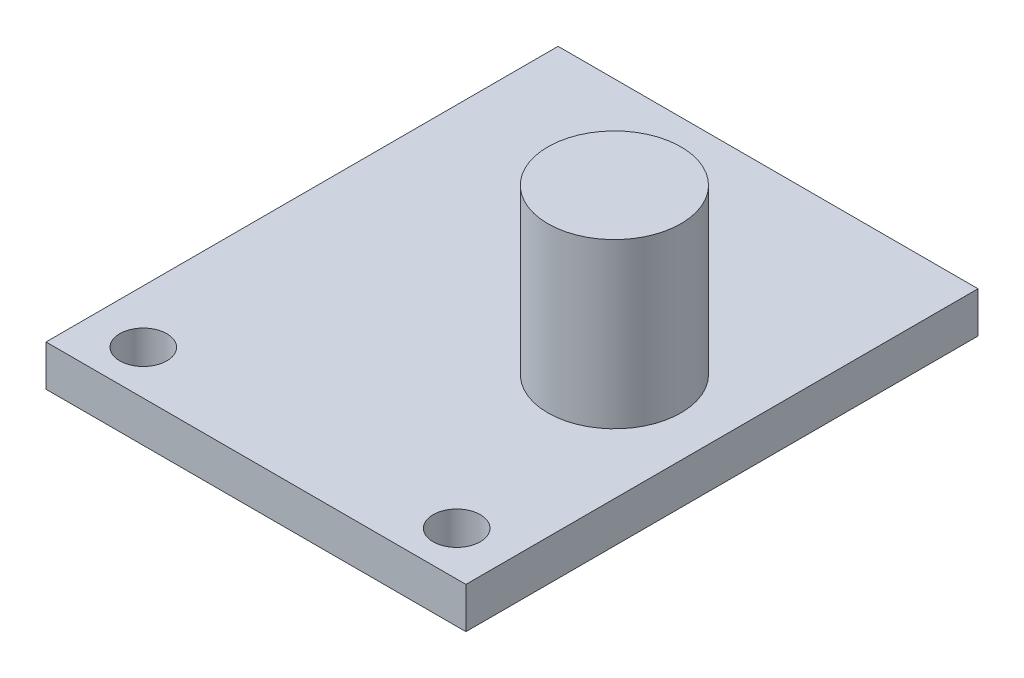
ISO-10303-21;
HEADER;
FILE_DESCRIPTION(('STEP AP214'),'2;1');
FILE_NAME('part.step','',(''),(''),'','','');
FILE_SCHEMA(('AUTOMOTIVE_DESIGN { 1 0 10303 214 1 1 1 1 }'));
ENDSEC;
DATA;
#1=APPLICATION_CONTEXT('core data for automotive mechanical design processes');
#2=APPLICATION_PROTOCOL_DEFINITION('international standard','automotive_design',2000,#1);
#3=PRODUCT_CONTEXT('',#1,'mechanical');
#4=PRODUCT('Part','Part','',(#3));
#5=PRODUCT_RELATED_PRODUCT_CATEGORY('part','',(#4));
#6=PRODUCT_DEFINITION_FORMATION('','',#4);
#7=PRODUCT_DEFINITION_CONTEXT('part definition',#1,'design');
#8=PRODUCT_DEFINITION('design','',#6,#7);
#9=PRODUCT_DEFINITION_SHAPE('','',#8);
#10=(LENGTH_UNIT() NAMED_UNIT(*) SI_UNIT(.MILLI.,.METRE.));
#11=(NAMED_UNIT(*) PLANE_ANGLE_UNIT() SI_UNIT($,.RADIAN.));
#12=(NAMED_UNIT(*) SI_UNIT($,.STERADIAN.) SOLID_ANGLE_UNIT());
#13=UNCERTAINTY_MEASURE_WITH_UNIT(LENGTH_MEASURE(1.E-05),#10,'distance_accuracy_value','');
#14=(GEOMETRIC_REPRESENTATION_CONTEXT(3) GLOBAL_UNCERTAINTY_ASSIGNED_CONTEXT((#13)) GLOBAL_UNIT_ASSIGNED_CONTEXT((#10,
#11,#12)) REPRESENTATION_CONTEXT('',''));
#15=CARTESIAN_POINT('',(0.,0.,0.));
#16=DIRECTION('',(0.,0.,1.));
#17=DIRECTION('',(1.,0.,0.));
#18=AXIS2_PLACEMENT_3D('',#15,#16,#17);
#19=CARTESIAN_POINT('',(10.25,2.,12.5));
#20=DIRECTION('',(-1.,0.,0.));
#21=DIRECTION('',(0.,0.,1.));
#22=AXIS2_PLACEMENT_3D('',#19,#20,#21);
#23=PLANE('',#22);
#24=DIRECTION('',(0.,0.,-1.));
#25=VECTOR('',#24,1.);
#26=CARTESIAN_POINT('',(10.25,0.,12.5));
#27=LINE('',#26,#25);
#28=CARTESIAN_POINT('',(10.25,0.,12.5));
#29=VERTEX_POINT('',#28);
#30=CARTESIAN_POINT('',(10.25,0.,-12.5));
#31=VERTEX_POINT('',#30);
#32=EDGE_CURVE('E102',#29,#31,#27,.T.);
#33=ORIENTED_EDGE('',*,*,#32,.T.);
#34=DIRECTION('',(0.,-1.,0.));
#35=VECTOR('',#34,1.);
#36=CARTESIAN_POINT('',(10.25,2.,-12.5));
#37=LINE('',#36,#35);
#38=CARTESIAN_POINT('',(10.25,2.,-12.5));
#39=VERTEX_POINT('',#38);
#40=EDGE_CURVE('E39',#39,#31,#37,.T.);
#41=ORIENTED_EDGE('',*,*,#40,.F.);
#42=DIRECTION('',(0.,0.,-1.));
#43=VECTOR('',#42,1.);
#44=CARTESIAN_POINT('',(10.25,2.,12.5));
#45=LINE('',#44,#43);
#46=CARTESIAN_POINT('',(10.25,2.,12.5));
#47=VERTEX_POINT('',#46);
#48=EDGE_CURVE('E89',#47,#39,#45,.T.);
#49=ORIENTED_EDGE('',*,*,#48,.F.);
#50=DIRECTION('',(0.,-1.,0.));
#51=VECTOR('',#50,1.);
#52=CARTESIAN_POINT('',(10.25,2.,12.5));
#53=LINE('',#52,#51);
#54=EDGE_CURVE('E98',#47,#29,#53,.T.);
#55=ORIENTED_EDGE('',*,*,#54,.T.);
#56=EDGE_LOOP('',(#33,#41,#49,#55));
#57=FACE_BOUND('',#56,.T.);
#58=ADVANCED_FACE('F36',(#57),#23,.F.);
#59=CARTESIAN_POINT('',(-10.25,2.,-12.5));
#60=DIRECTION('',(0.,0.,1.));
#61=DIRECTION('',(1.,0.,0.));
#62=AXIS2_PLACEMENT_3D('',#59,#60,#61);
#63=PLANE('',#62);
#64=DIRECTION('',(-1.,0.,0.));
#65=VECTOR('',#64,1.);
#66=CARTESIAN_POINT('',(-10.25,0.,-12.5));
#67=LINE('',#66,#65);
#68=CARTESIAN_POINT('',(-10.25,0.,-12.5));
#69=VERTEX_POINT('',#68);
#70=EDGE_CURVE('E94',#31,#69,#67,.T.);
#71=ORIENTED_EDGE('',*,*,#70,.T.);
#72=DIRECTION('',(0.,-1.,0.));
#73=VECTOR('',#72,1.);
#74=CARTESIAN_POINT('',(-10.25,2.,-12.5));
#75=LINE('',#74,#73);
#76=CARTESIAN_POINT('',(-10.25,2.,-12.5));
#77=VERTEX_POINT('',#76);
#78=EDGE_CURVE('E92',#77,#69,#75,.T.);
#79=ORIENTED_EDGE('',*,*,#78,.F.);
#80=DIRECTION('',(-1.,0.,0.));
#81=VECTOR('',#80,1.);
#82=CARTESIAN_POINT('',(-10.25,2.,-12.5));
#83=LINE('',#82,#81);
#84=EDGE_CURVE('E84',#39,#77,#83,.T.);
#85=ORIENTED_EDGE('',*,*,#84,.F.);
#86=ORIENTED_EDGE('',*,*,#40,.T.);
#87=EDGE_LOOP('',(#71,#79,#85,#86));
#88=FACE_BOUND('',#87,.T.);
#89=ADVANCED_FACE('F93',(#88),#63,.F.);
#90=CARTESIAN_POINT('',(-10.25,2.,12.5));
#91=DIRECTION('',(1.,0.,0.));
#92=DIRECTION('',(0.,0.,-1.));
#93=AXIS2_PLACEMENT_3D('',#90,#91,#92);
#94=PLANE('',#93);
#95=DIRECTION('',(0.,0.,1.));
#96=VECTOR('',#95,1.);
#97=CARTESIAN_POINT('',(-10.25,0.,12.5));
#98=LINE('',#97,#96);
#99=CARTESIAN_POINT('',(-10.25,0.,12.5));
#100=VERTEX_POINT('',#99);
#101=EDGE_CURVE('E70',#69,#100,#98,.T.);
#102=ORIENTED_EDGE('',*,*,#101,.T.);
#103=DIRECTION('',(0.,-1.,0.));
#104=VECTOR('',#103,1.);
#105=CARTESIAN_POINT('',(-10.25,2.,12.5));
#106=LINE('',#105,#104);
#107=CARTESIAN_POINT('',(-10.25,2.,12.5));
#108=VERTEX_POINT('',#107);
#109=EDGE_CURVE('E95',#108,#100,#106,.T.);
#110=ORIENTED_EDGE('',*,*,#109,.F.);
#111=DIRECTION('',(0.,0.,1.));
#112=VECTOR('',#111,1.);
#113=CARTESIAN_POINT('',(-10.25,2.,12.5));
#114=LINE('',#113,#112);
#115=EDGE_CURVE('E87',#77,#108,#114,.T.);
#116=ORIENTED_EDGE('',*,*,#115,.F.);
#117=ORIENTED_EDGE('',*,*,#78,.T.);
#118=EDGE_LOOP('',(#102,#110,#116,#117));
#119=FACE_BOUND('',#118,.T.);
#120=ADVANCED_FACE('F96',(#119),#94,.F.);
#121=CARTESIAN_POINT('',(-10.25,2.,12.5));
#122=DIRECTION('',(0.,0.,-1.));
#123=DIRECTION('',(-1.,0.,0.));
#124=AXIS2_PLACEMENT_3D('',#121,#122,#123);
#125=PLANE('',#124);
#126=DIRECTION('',(1.,0.,0.));
#127=VECTOR('',#126,1.);
#128=CARTESIAN_POINT('',(-10.25,0.,12.5));
#129=LINE('',#128,#127);
#130=EDGE_CURVE('E76',#100,#29,#129,.T.);
#131=ORIENTED_EDGE('',*,*,#130,.T.);
#132=ORIENTED_EDGE('',*,*,#54,.F.);
#133=DIRECTION('',(1.,0.,0.));
#134=VECTOR('',#133,1.);
#135=CARTESIAN_POINT('',(-10.25,2.,12.5));
#136=LINE('',#135,#134);
#137=EDGE_CURVE('E53',#108,#47,#136,.T.);
#138=ORIENTED_EDGE('',*,*,#137,.F.);
#139=ORIENTED_EDGE('',*,*,#109,.T.);
#140=EDGE_LOOP('',(#131,#132,#138,#139));
#141=FACE_BOUND('',#140,.T.);
#142=ADVANCED_FACE('F110',(#141),#125,.F.);
#143=CARTESIAN_POINT('',(0.,2.,0.));
#144=DIRECTION('',(0.,-1.,0.));
#145=DIRECTION('',(0.,0.,-1.));
#146=AXIS2_PLACEMENT_3D('',#143,#144,#145);
#147=PLANE('',#146);
#148=CARTESIAN_POINT('',(5.,2.,0.));
#149=DIRECTION('',(0.,1.,0.));
#150=DIRECTION('',(0.,0.,1.));
#151=AXIS2_PLACEMENT_3D('',#148,#149,#150);
#152=CIRCLE('',#151,3.25);
#153=CARTESIAN_POINT('',(5.,2.,3.25));
#154=VERTEX_POINT('',#153);
#155=EDGE_CURVE('E11',#154,#154,#152,.T.);
#156=ORIENTED_EDGE('',*,*,#155,.F.);
#157=EDGE_LOOP('',(#156));
#158=FACE_BOUND('',#157,.T.);
#159=CARTESIAN_POINT('',(7.65,2.,10.35));
#160=DIRECTION('',(0.,1.,0.));
#161=DIRECTION('',(0.,0.,1.));
#162=AXIS2_PLACEMENT_3D('',#159,#160,#161);
#163=CIRCLE('',#162,1.15);
#164=CARTESIAN_POINT('',(7.65,2.,11.5));
#165=VERTEX_POINT('',#164);
#166=EDGE_CURVE('E123',#165,#165,#163,.T.);
#167=ORIENTED_EDGE('',*,*,#166,.F.);
#168=EDGE_LOOP('',(#167));
#169=FACE_BOUND('',#168,.T.);
#170=CARTESIAN_POINT('',(-7.65,2.,10.35));
#171=DIRECTION('',(0.,1.,0.));
#172=DIRECTION('',(0.,0.,1.));
#173=AXIS2_PLACEMENT_3D('',#170,#171,#172);
#174=CIRCLE('',#173,1.15);
#175=CARTESIAN_POINT('',(-7.65,2.,11.5));
#176=VERTEX_POINT('',#175);
#177=EDGE_CURVE('E116',#176,#176,#174,.T.);
#178=ORIENTED_EDGE('',*,*,#177,.F.);
#179=EDGE_LOOP('',(#178));
#180=FACE_BOUND('',#179,.T.);
#181=ORIENTED_EDGE('',*,*,#48,.T.);
#182=ORIENTED_EDGE('',*,*,#84,.T.);
#183=ORIENTED_EDGE('',*,*,#115,.T.);
#184=ORIENTED_EDGE('',*,*,#137,.T.);
#185=EDGE_LOOP('',(#181,#182,#183,#184));
#186=FACE_BOUND('',#185,.T.);
#187=ADVANCED_FACE('F85',(#158,#169,#180,#186),#147,.F.);
#188=CARTESIAN_POINT('',(0.,0.,0.));
#189=DIRECTION('',(0.,-1.,0.));
#190=DIRECTION('',(0.,0.,-1.));
#191=AXIS2_PLACEMENT_3D('',#188,#189,#190);
#192=PLANE('',#191);
#193=CARTESIAN_POINT('',(7.65,0.,10.35));
#194=DIRECTION('',(0.,1.,0.));
#195=DIRECTION('',(0.,0.,1.));
#196=AXIS2_PLACEMENT_3D('',#193,#194,#195);
#197=CIRCLE('',#196,1.15);
#198=CARTESIAN_POINT('',(7.65,0.,11.5));
#199=VERTEX_POINT('',#198);
#200=EDGE_CURVE('E105',#199,#199,#197,.T.);
#201=ORIENTED_EDGE('',*,*,#200,.T.);
#202=EDGE_LOOP('',(#201));
#203=FACE_BOUND('',#202,.T.);
#204=CARTESIAN_POINT('',(-7.65,0.,10.35));
#205=DIRECTION('',(0.,1.,0.));
#206=DIRECTION('',(0.,0.,1.));
#207=AXIS2_PLACEMENT_3D('',#204,#205,#206);
#208=CIRCLE('',#207,1.15);
#209=CARTESIAN_POINT('',(-7.65,0.,11.5));
#210=VERTEX_POINT('',#209);
#211=EDGE_CURVE('E119',#210,#210,#208,.T.);
#212=ORIENTED_EDGE('',*,*,#211,.T.);
#213=EDGE_LOOP('',(#212));
#214=FACE_BOUND('',#213,.T.);
#215=ORIENTED_EDGE('',*,*,#32,.F.);
#216=ORIENTED_EDGE('',*,*,#130,.F.);
#217=ORIENTED_EDGE('',*,*,#101,.F.);
#218=ORIENTED_EDGE('',*,*,#70,.F.);
#219=EDGE_LOOP('',(#215,#216,#217,#218));
#220=FACE_BOUND('',#219,.T.);
#221=ADVANCED_FACE('F113',(#203,#214,#220),#192,.T.);
#222=CARTESIAN_POINT('',(-7.65,0.,10.35));
#223=DIRECTION('',(0.,1.,0.));
#224=DIRECTION('',(0.,0.,1.));
#225=AXIS2_PLACEMENT_3D('',#222,#223,#224);
#226=CYLINDRICAL_SURFACE('',#225,1.15);
#227=ORIENTED_EDGE('',*,*,#211,.F.);
#228=EDGE_LOOP('',(#227));
#229=FACE_BOUND('',#228,.T.);
#230=ORIENTED_EDGE('',*,*,#177,.T.);
#231=EDGE_LOOP('',(#230));
#232=FACE_BOUND('',#231,.T.);
#233=ADVANCED_FACE('F147',(#229,#232),#226,.F.);
#234=CARTESIAN_POINT('',(7.65,0.,10.35));
#235=DIRECTION('',(0.,1.,0.));
#236=DIRECTION('',(0.,0.,1.));
#237=AXIS2_PLACEMENT_3D('',#234,#235,#236);
#238=CYLINDRICAL_SURFACE('',#237,1.15);
#239=ORIENTED_EDGE('',*,*,#200,.F.);
#240=EDGE_LOOP('',(#239));
#241=FACE_BOUND('',#240,.T.);
#242=ORIENTED_EDGE('',*,*,#166,.T.);
#243=EDGE_LOOP('',(#242));
#244=FACE_BOUND('',#243,.T.);
#245=ADVANCED_FACE('F136',(#241,#244),#238,.F.);
#246=CARTESIAN_POINT('',(5.,10.,0.));
#247=DIRECTION('',(0.,-1.,0.));
#248=DIRECTION('',(0.,0.,-1.));
#249=AXIS2_PLACEMENT_3D('',#246,#247,#248);
#250=CYLINDRICAL_SURFACE('',#249,3.25);
#251=CARTESIAN_POINT('',(5.,10.,0.));
#252=DIRECTION('',(0.,1.,0.));
#253=DIRECTION('',(0.,0.,1.));
#254=AXIS2_PLACEMENT_3D('',#251,#252,#253);
#255=CIRCLE('',#254,3.25);
#256=CARTESIAN_POINT('',(5.,10.,3.25));
#257=VERTEX_POINT('',#256);
#258=EDGE_CURVE('E120',#257,#257,#255,.T.);
#259=ORIENTED_EDGE('',*,*,#258,.F.);
#260=EDGE_LOOP('',(#259));
#261=FACE_BOUND('',#260,.T.);
#262=ORIENTED_EDGE('',*,*,#155,.T.);
#263=EDGE_LOOP('',(#262));
#264=FACE_BOUND('',#263,.T.);
#265=ADVANCED_FACE('F133',(#261,#264),#250,.T.);
#266=CARTESIAN_POINT('',(5.,10.,0.));
#267=DIRECTION('',(0.,1.,0.));
#268=DIRECTION('',(0.,0.,1.));
#269=AXIS2_PLACEMENT_3D('',#266,#267,#268);
#270=PLANE('',#269);
#271=ORIENTED_EDGE('',*,*,#258,.T.);
#272=EDGE_LOOP('',(#271));
#273=FACE_BOUND('',#272,.T.);
#274=ADVANCED_FACE('F131',(#273),#270,.T.);
#275=CLOSED_SHELL('',(#58,#89,#120,#142,#187,#221,#233,#245,#265,#274));
#276=MANIFOLD_SOLID_BREP('B2',#275);
#277=ADVANCED_BREP_SHAPE_REPRESENTATION('',(#18,#276),#14);
#278=SHAPE_DEFINITION_REPRESENTATION(#9,#277);
ENDSEC;
END-ISO-10303-21;
